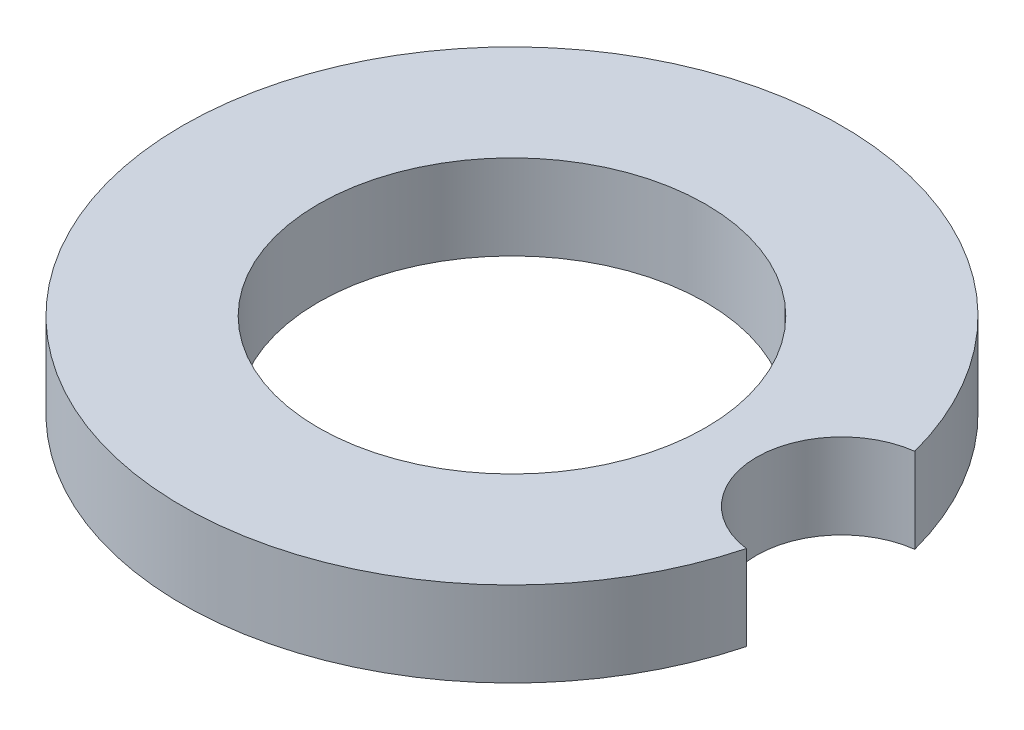
ISO-10303-21;
HEADER;
FILE_DESCRIPTION(('STEP AP214'),'2;1');
FILE_NAME('part.step','',(''),(''),'','','');
FILE_SCHEMA(('AUTOMOTIVE_DESIGN { 1 0 10303 214 1 1 1 1 }'));
ENDSEC;
DATA;
#1=APPLICATION_CONTEXT('core data for automotive mechanical design processes');
#2=APPLICATION_PROTOCOL_DEFINITION('international standard','automotive_design',2000,#1);
#3=PRODUCT_CONTEXT('',#1,'mechanical');
#4=PRODUCT('Part','Part','',(#3));
#5=PRODUCT_RELATED_PRODUCT_CATEGORY('part','',(#4));
#6=PRODUCT_DEFINITION_FORMATION('','',#4);
#7=PRODUCT_DEFINITION_CONTEXT('part definition',#1,'design');
#8=PRODUCT_DEFINITION('design','',#6,#7);
#9=PRODUCT_DEFINITION_SHAPE('','',#8);
#10=(LENGTH_UNIT() NAMED_UNIT(*) SI_UNIT(.MILLI.,.METRE.));
#11=(NAMED_UNIT(*) PLANE_ANGLE_UNIT() SI_UNIT($,.RADIAN.));
#12=(NAMED_UNIT(*) SI_UNIT($,.STERADIAN.) SOLID_ANGLE_UNIT());
#13=UNCERTAINTY_MEASURE_WITH_UNIT(LENGTH_MEASURE(1.E-05),#10,'distance_accuracy_value','');
#14=(GEOMETRIC_REPRESENTATION_CONTEXT(3) GLOBAL_UNCERTAINTY_ASSIGNED_CONTEXT((#13)) GLOBAL_UNIT_ASSIGNED_CONTEXT((#10,
#11,#12)) REPRESENTATION_CONTEXT('',''));
#15=CARTESIAN_POINT('',(0.,0.,0.));
#16=DIRECTION('',(0.,0.,1.));
#17=DIRECTION('',(1.,0.,0.));
#18=AXIS2_PLACEMENT_3D('',#15,#16,#17);
#19=CARTESIAN_POINT('',(0.,12.7,0.));
#20=DIRECTION('',(0.,-1.,0.));
#21=DIRECTION('',(0.,0.,-1.));
#22=AXIS2_PLACEMENT_3D('',#19,#20,#21);
#23=CYLINDRICAL_SURFACE('',#22,49.276);
#24=CARTESIAN_POINT('',(0.,0.,0.));
#25=DIRECTION('',(0.,1.,0.));
#26=DIRECTION('',(0.,0.,1.));
#27=AXIS2_PLACEMENT_3D('',#24,#25,#26);
#28=CIRCLE('',#27,49.276);
#29=CARTESIAN_POINT('',(47.6394020618557,0.,-12.5941076376559));
#30=VERTEX_POINT('',#29);
#31=CARTESIAN_POINT('',(47.6394020618557,0.,12.5941076376559));
#32=VERTEX_POINT('',#31);
#33=EDGE_CURVE('E46',#30,#32,#28,.T.);
#34=ORIENTED_EDGE('',*,*,#33,.T.);
#35=DIRECTION('',(0.,1.,0.));
#36=VECTOR('',#35,1.);
#37=CARTESIAN_POINT('',(47.6394020618557,6.35,12.5941076376559));
#38=LINE('',#37,#36);
#39=CARTESIAN_POINT('',(47.6394020618557,12.7,12.5941076376559));
#40=VERTEX_POINT('',#39);
#41=EDGE_CURVE('E58',#32,#40,#38,.T.);
#42=ORIENTED_EDGE('',*,*,#41,.T.);
#43=CARTESIAN_POINT('',(0.,12.7,0.));
#44=DIRECTION('',(0.,1.,0.));
#45=DIRECTION('',(0.,0.,1.));
#46=AXIS2_PLACEMENT_3D('',#43,#44,#45);
#47=CIRCLE('',#46,49.276);
#48=CARTESIAN_POINT('',(47.6394020618557,12.7,-12.5941076376559));
#49=VERTEX_POINT('',#48);
#50=EDGE_CURVE('E11',#49,#40,#47,.T.);
#51=ORIENTED_EDGE('',*,*,#50,.F.);
#52=DIRECTION('',(0.,1.,0.));
#53=VECTOR('',#52,1.);
#54=CARTESIAN_POINT('',(47.6394020618557,6.35,-12.5941076376559));
#55=LINE('',#54,#53);
#56=EDGE_CURVE('E70',#49,#30,#55,.F.);
#57=ORIENTED_EDGE('',*,*,#56,.T.);
#58=EDGE_LOOP('',(#34,#42,#51,#57));
#59=FACE_BOUND('',#58,.T.);
#60=ADVANCED_FACE('F43',(#59),#23,.T.);
#61=CARTESIAN_POINT('',(0.,12.7,0.));
#62=DIRECTION('',(0.,1.,0.));
#63=DIRECTION('',(0.,0.,1.));
#64=AXIS2_PLACEMENT_3D('',#61,#62,#63);
#65=PLANE('',#64);
#66=CARTESIAN_POINT('',(49.276,12.7,0.));
#67=DIRECTION('',(0.,1.,0.));
#68=DIRECTION('',(0.,0.,1.));
#69=AXIS2_PLACEMENT_3D('',#66,#67,#68);
#70=CIRCLE('',#69,12.7);
#71=EDGE_CURVE('E63',#49,#40,#70,.T.);
#72=ORIENTED_EDGE('',*,*,#71,.F.);
#73=ORIENTED_EDGE('',*,*,#50,.T.);
#74=EDGE_LOOP('',(#72,#73));
#75=FACE_BOUND('',#74,.T.);
#76=CARTESIAN_POINT('',(0.,12.7,0.));
#77=DIRECTION('',(0.,1.,0.));
#78=DIRECTION('',(0.,0.,1.));
#79=AXIS2_PLACEMENT_3D('',#76,#77,#78);
#80=CIRCLE('',#79,28.952599956);
#81=CARTESIAN_POINT('',(0.,12.7,28.952599956));
#82=VERTEX_POINT('',#81);
#83=EDGE_CURVE('E82',#82,#82,#80,.T.);
#84=ORIENTED_EDGE('',*,*,#83,.F.);
#85=EDGE_LOOP('',(#84));
#86=FACE_BOUND('',#85,.T.);
#87=ADVANCED_FACE('F97',(#75,#86),#65,.T.);
#88=CARTESIAN_POINT('',(0.,0.,0.));
#89=DIRECTION('',(0.,1.,0.));
#90=DIRECTION('',(0.,0.,1.));
#91=AXIS2_PLACEMENT_3D('',#88,#89,#90);
#92=PLANE('',#91);
#93=CARTESIAN_POINT('',(0.,0.,0.));
#94=DIRECTION('',(0.,1.,0.));
#95=DIRECTION('',(0.,0.,1.));
#96=AXIS2_PLACEMENT_3D('',#93,#94,#95);
#97=CIRCLE('',#96,28.952599956);
#98=CARTESIAN_POINT('',(0.,0.,28.952599956));
#99=VERTEX_POINT('',#98);
#100=EDGE_CURVE('E85',#99,#99,#97,.T.);
#101=ORIENTED_EDGE('',*,*,#100,.T.);
#102=EDGE_LOOP('',(#101));
#103=FACE_BOUND('',#102,.T.);
#104=ORIENTED_EDGE('',*,*,#33,.F.);
#105=CARTESIAN_POINT('',(49.276,0.,0.));
#106=DIRECTION('',(0.,1.,0.));
#107=DIRECTION('',(0.,0.,1.));
#108=AXIS2_PLACEMENT_3D('',#105,#106,#107);
#109=CIRCLE('',#108,12.7);
#110=EDGE_CURVE('E67',#30,#32,#109,.T.);
#111=ORIENTED_EDGE('',*,*,#110,.T.);
#112=EDGE_LOOP('',(#104,#111));
#113=FACE_BOUND('',#112,.T.);
#114=ADVANCED_FACE('F80',(#103,#113),#92,.F.);
#115=CARTESIAN_POINT('',(0.,12.7,0.));
#116=DIRECTION('',(0.,-1.,0.));
#117=DIRECTION('',(0.,0.,-1.));
#118=AXIS2_PLACEMENT_3D('',#115,#116,#117);
#119=CYLINDRICAL_SURFACE('',#118,28.952599956);
#120=ORIENTED_EDGE('',*,*,#83,.T.);
#121=EDGE_LOOP('',(#120));
#122=FACE_BOUND('',#121,.T.);
#123=ORIENTED_EDGE('',*,*,#100,.F.);
#124=EDGE_LOOP('',(#123));
#125=FACE_BOUND('',#124,.T.);
#126=ADVANCED_FACE('F105',(#122,#125),#119,.F.);
#127=CARTESIAN_POINT('',(49.276,0.,0.));
#128=DIRECTION('',(0.,1.,0.));
#129=DIRECTION('',(0.,0.,1.));
#130=AXIS2_PLACEMENT_3D('',#127,#128,#129);
#131=CYLINDRICAL_SURFACE('',#130,12.7);
#132=ORIENTED_EDGE('',*,*,#110,.F.);
#133=ORIENTED_EDGE('',*,*,#56,.F.);
#134=ORIENTED_EDGE('',*,*,#71,.T.);
#135=ORIENTED_EDGE('',*,*,#41,.F.);
#136=EDGE_LOOP('',(#132,#133,#134,#135));
#137=FACE_BOUND('',#136,.T.);
#138=ADVANCED_FACE('F69',(#137),#131,.F.);
#139=CLOSED_SHELL('',(#60,#87,#114,#126,#138));
#140=MANIFOLD_SOLID_BREP('B2',#139);
#141=ADVANCED_BREP_SHAPE_REPRESENTATION('',(#18,#140),#14);
#142=SHAPE_DEFINITION_REPRESENTATION(#9,#141);
ENDSEC;
END-ISO-10303-21;
